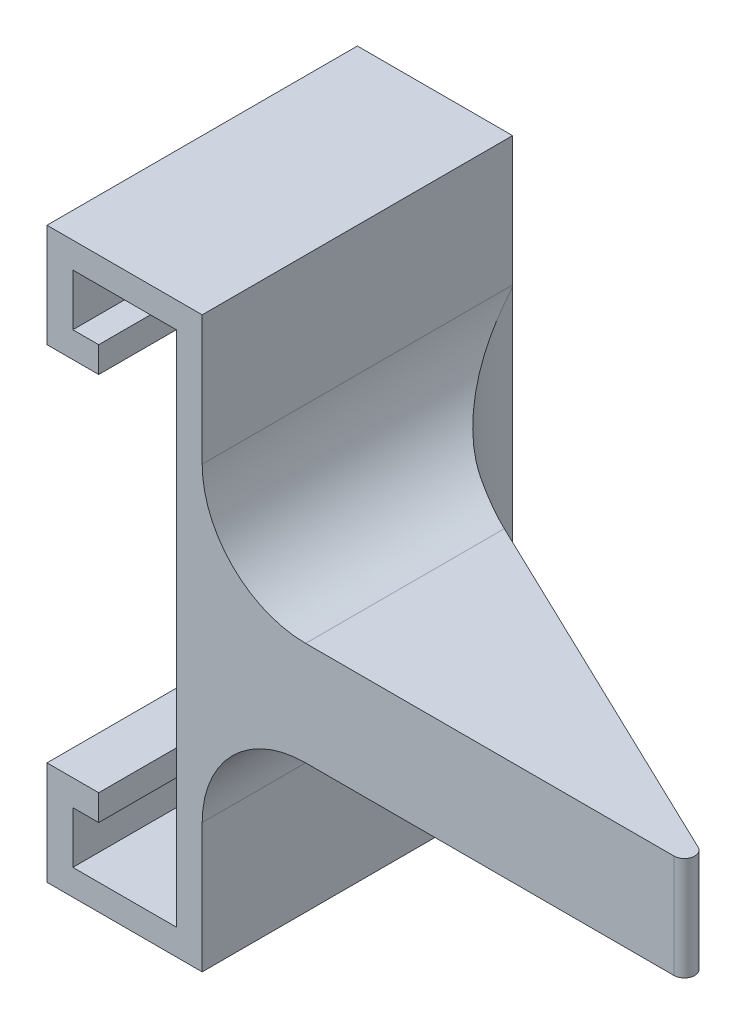
ISO-10303-21;
HEADER;
FILE_DESCRIPTION(('STEP AP214'),'2;1');
FILE_NAME('part.step','',(''),(''),'','','');
FILE_SCHEMA(('AUTOMOTIVE_DESIGN { 1 0 10303 214 1 1 1 1 }'));
ENDSEC;
DATA;
#1=APPLICATION_CONTEXT('core data for automotive mechanical design processes');
#2=APPLICATION_PROTOCOL_DEFINITION('international standard','automotive_design',2000,#1);
#3=PRODUCT_CONTEXT('',#1,'mechanical');
#4=PRODUCT('Part','Part','',(#3));
#5=PRODUCT_RELATED_PRODUCT_CATEGORY('part','',(#4));
#6=PRODUCT_DEFINITION_FORMATION('','',#4);
#7=PRODUCT_DEFINITION_CONTEXT('part definition',#1,'design');
#8=PRODUCT_DEFINITION('design','',#6,#7);
#9=PRODUCT_DEFINITION_SHAPE('','',#8);
#10=(LENGTH_UNIT() NAMED_UNIT(*) SI_UNIT(.MILLI.,.METRE.));
#11=(NAMED_UNIT(*) PLANE_ANGLE_UNIT() SI_UNIT($,.RADIAN.));
#12=(NAMED_UNIT(*) SI_UNIT($,.STERADIAN.) SOLID_ANGLE_UNIT());
#13=UNCERTAINTY_MEASURE_WITH_UNIT(LENGTH_MEASURE(1.E-05),#10,'distance_accuracy_value','');
#14=(GEOMETRIC_REPRESENTATION_CONTEXT(3) GLOBAL_UNCERTAINTY_ASSIGNED_CONTEXT((#13)) GLOBAL_UNIT_ASSIGNED_CONTEXT((#10,
#11,#12)) REPRESENTATION_CONTEXT('',''));
#15=CARTESIAN_POINT('',(0.,0.,0.));
#16=DIRECTION('',(0.,0.,1.));
#17=DIRECTION('',(1.,0.,0.));
#18=AXIS2_PLACEMENT_3D('',#15,#16,#17);
#19=CARTESIAN_POINT('',(10.,10.,30.));
#20=DIRECTION('',(-1.,0.,0.));
#21=DIRECTION('',(0.,-1.,0.));
#22=AXIS2_PLACEMENT_3D('',#19,#20,#21);
#23=PLANE('',#22);
#24=DIRECTION('',(0.,1.,0.));
#25=VECTOR('',#24,1.);
#26=CARTESIAN_POINT('',(10.,10.,30.));
#27=LINE('',#26,#25);
#28=CARTESIAN_POINT('',(10.,-2.50000000000001,30.));
#29=VERTEX_POINT('',#28);
#30=CARTESIAN_POINT('',(10.,10.,30.));
#31=VERTEX_POINT('',#30);
#32=EDGE_CURVE('E376',#29,#31,#27,.T.);
#33=ORIENTED_EDGE('',*,*,#32,.F.);
#34=DIRECTION('',(0.,0.,-1.));
#35=VECTOR('',#34,1.);
#36=CARTESIAN_POINT('',(10.,-2.50000000000001,30.));
#37=LINE('',#36,#35);
#38=CARTESIAN_POINT('',(10.,-2.50000000000001,0.));
#39=VERTEX_POINT('',#38);
#40=EDGE_CURVE('E226',#29,#39,#37,.T.);
#41=ORIENTED_EDGE('',*,*,#40,.T.);
#42=DIRECTION('',(0.,1.,0.));
#43=VECTOR('',#42,1.);
#44=CARTESIAN_POINT('',(10.,10.,0.));
#45=LINE('',#44,#43);
#46=CARTESIAN_POINT('',(10.,10.,0.));
#47=VERTEX_POINT('',#46);
#48=EDGE_CURVE('E398',#39,#47,#45,.T.);
#49=ORIENTED_EDGE('',*,*,#48,.T.);
#50=DIRECTION('',(0.,0.,-1.));
#51=VECTOR('',#50,1.);
#52=CARTESIAN_POINT('',(10.,10.,30.));
#53=LINE('',#52,#51);
#54=EDGE_CURVE('E380',#31,#47,#53,.T.);
#55=ORIENTED_EDGE('',*,*,#54,.F.);
#56=EDGE_LOOP('',(#33,#41,#49,#55));
#57=FACE_BOUND('',#56,.T.);
#58=ADVANCED_FACE('F41',(#57),#23,.F.);
#59=CARTESIAN_POINT('',(10.,-45.,0.));
#60=VERTEX_POINT('',#59);
#61=CARTESIAN_POINT('',(10.,-32.5,0.));
#62=VERTEX_POINT('',#61);
#63=EDGE_CURVE('E397',#60,#62,#45,.T.);
#64=ORIENTED_EDGE('',*,*,#63,.T.);
#65=DIRECTION('',(0.,0.,-1.));
#66=VECTOR('',#65,1.);
#67=CARTESIAN_POINT('',(10.,-32.5,30.));
#68=LINE('',#67,#66);
#69=CARTESIAN_POINT('',(10.,-32.5,30.));
#70=VERTEX_POINT('',#69);
#71=EDGE_CURVE('E224',#62,#70,#68,.F.);
#72=ORIENTED_EDGE('',*,*,#71,.T.);
#73=CARTESIAN_POINT('',(10.,-45.,30.));
#74=VERTEX_POINT('',#73);
#75=EDGE_CURVE('E382',#74,#70,#27,.T.);
#76=ORIENTED_EDGE('',*,*,#75,.F.);
#77=DIRECTION('',(0.,0.,-1.));
#78=VECTOR('',#77,1.);
#79=CARTESIAN_POINT('',(10.,-45.,30.));
#80=LINE('',#79,#78);
#81=EDGE_CURVE('E418',#74,#60,#80,.T.);
#82=ORIENTED_EDGE('',*,*,#81,.T.);
#83=EDGE_LOOP('',(#64,#72,#76,#82));
#84=FACE_BOUND('',#83,.T.);
#85=ADVANCED_FACE('F290',(#84),#23,.F.);
#86=CARTESIAN_POINT('',(0.,2.5,30.));
#87=DIRECTION('',(-1.,0.,0.));
#88=DIRECTION('',(0.,-1.,0.));
#89=AXIS2_PLACEMENT_3D('',#86,#87,#88);
#90=PLANE('',#89);
#91=DIRECTION('',(0.,1.,0.));
#92=VECTOR('',#91,1.);
#93=CARTESIAN_POINT('',(0.,2.5,0.));
#94=LINE('',#93,#92);
#95=CARTESIAN_POINT('',(0.,0.,0.));
#96=VERTEX_POINT('',#95);
#97=CARTESIAN_POINT('',(0.,2.5,0.));
#98=VERTEX_POINT('',#97);
#99=EDGE_CURVE('E223',#96,#98,#94,.T.);
#100=ORIENTED_EDGE('',*,*,#99,.T.);
#101=DIRECTION('',(0.,0.,-1.));
#102=VECTOR('',#101,1.);
#103=CARTESIAN_POINT('',(0.,2.5,30.));
#104=LINE('',#103,#102);
#105=CARTESIAN_POINT('',(0.,2.5,30.));
#106=VERTEX_POINT('',#105);
#107=EDGE_CURVE('E204',#106,#98,#104,.T.);
#108=ORIENTED_EDGE('',*,*,#107,.F.);
#109=DIRECTION('',(0.,1.,0.));
#110=VECTOR('',#109,1.);
#111=CARTESIAN_POINT('',(0.,2.5,30.));
#112=LINE('',#111,#110);
#113=CARTESIAN_POINT('',(0.,0.,30.));
#114=VERTEX_POINT('',#113);
#115=EDGE_CURVE('E210',#114,#106,#112,.T.);
#116=ORIENTED_EDGE('',*,*,#115,.F.);
#117=DIRECTION('',(0.,0.,-1.));
#118=VECTOR('',#117,1.);
#119=CARTESIAN_POINT('',(0.,0.,30.));
#120=LINE('',#119,#118);
#121=EDGE_CURVE('E409',#114,#96,#120,.T.);
#122=ORIENTED_EDGE('',*,*,#121,.T.);
#123=EDGE_LOOP('',(#100,#108,#116,#122));
#124=FACE_BOUND('',#123,.T.);
#125=ADVANCED_FACE('F221',(#124),#90,.F.);
#126=CARTESIAN_POINT('',(-2.5,2.5,30.));
#127=DIRECTION('',(0.,-1.,0.));
#128=DIRECTION('',(0.,0.,-1.));
#129=AXIS2_PLACEMENT_3D('',#126,#127,#128);
#130=PLANE('',#129);
#131=DIRECTION('',(-1.,0.,0.));
#132=VECTOR('',#131,1.);
#133=CARTESIAN_POINT('',(-2.5,2.5,0.));
#134=LINE('',#133,#132);
#135=CARTESIAN_POINT('',(-2.5,2.5,0.));
#136=VERTEX_POINT('',#135);
#137=EDGE_CURVE('E459',#98,#136,#134,.T.);
#138=ORIENTED_EDGE('',*,*,#137,.T.);
#139=DIRECTION('',(0.,0.,-1.));
#140=VECTOR('',#139,1.);
#141=CARTESIAN_POINT('',(-2.5,2.5,30.));
#142=LINE('',#141,#140);
#143=CARTESIAN_POINT('',(-2.5,2.5,30.));
#144=VERTEX_POINT('',#143);
#145=EDGE_CURVE('E207',#144,#136,#142,.T.);
#146=ORIENTED_EDGE('',*,*,#145,.F.);
#147=DIRECTION('',(-1.,0.,0.));
#148=VECTOR('',#147,1.);
#149=CARTESIAN_POINT('',(-2.5,2.5,30.));
#150=LINE('',#149,#148);
#151=EDGE_CURVE('E200',#106,#144,#150,.T.);
#152=ORIENTED_EDGE('',*,*,#151,.F.);
#153=ORIENTED_EDGE('',*,*,#107,.T.);
#154=EDGE_LOOP('',(#138,#146,#152,#153));
#155=FACE_BOUND('',#154,.T.);
#156=ADVANCED_FACE('F202',(#155),#130,.F.);
#157=CARTESIAN_POINT('',(-2.5,7.5,30.));
#158=DIRECTION('',(-1.,0.,0.));
#159=DIRECTION('',(0.,-1.,0.));
#160=AXIS2_PLACEMENT_3D('',#157,#158,#159);
#161=PLANE('',#160);
#162=DIRECTION('',(0.,1.,0.));
#163=VECTOR('',#162,1.);
#164=CARTESIAN_POINT('',(-2.5,7.5,0.));
#165=LINE('',#164,#163);
#166=CARTESIAN_POINT('',(-2.5,7.5,0.));
#167=VERTEX_POINT('',#166);
#168=EDGE_CURVE('E453',#136,#167,#165,.T.);
#169=ORIENTED_EDGE('',*,*,#168,.T.);
#170=DIRECTION('',(0.,0.,-1.));
#171=VECTOR('',#170,1.);
#172=CARTESIAN_POINT('',(-2.5,7.5,30.));
#173=LINE('',#172,#171);
#174=CARTESIAN_POINT('',(-2.5,7.5,30.));
#175=VERTEX_POINT('',#174);
#176=EDGE_CURVE('E228',#175,#167,#173,.T.);
#177=ORIENTED_EDGE('',*,*,#176,.F.);
#178=DIRECTION('',(0.,1.,0.));
#179=VECTOR('',#178,1.);
#180=CARTESIAN_POINT('',(-2.5,7.5,30.));
#181=LINE('',#180,#179);
#182=EDGE_CURVE('E209',#144,#175,#181,.T.);
#183=ORIENTED_EDGE('',*,*,#182,.F.);
#184=ORIENTED_EDGE('',*,*,#145,.T.);
#185=EDGE_LOOP('',(#169,#177,#183,#184));
#186=FACE_BOUND('',#185,.T.);
#187=ADVANCED_FACE('F328',(#186),#161,.F.);
#188=CARTESIAN_POINT('',(7.5,7.5,30.));
#189=DIRECTION('',(0.,1.,0.));
#190=DIRECTION('',(-1.,0.,0.));
#191=AXIS2_PLACEMENT_3D('',#188,#189,#190);
#192=PLANE('',#191);
#193=DIRECTION('',(1.,0.,0.));
#194=VECTOR('',#193,1.);
#195=CARTESIAN_POINT('',(7.5,7.5,0.));
#196=LINE('',#195,#194);
#197=CARTESIAN_POINT('',(7.5,7.5,0.));
#198=VERTEX_POINT('',#197);
#199=EDGE_CURVE('E449',#167,#198,#196,.T.);
#200=ORIENTED_EDGE('',*,*,#199,.T.);
#201=DIRECTION('',(0.,0.,-1.));
#202=VECTOR('',#201,1.);
#203=CARTESIAN_POINT('',(7.5,7.5,30.));
#204=LINE('',#203,#202);
#205=CARTESIAN_POINT('',(7.5,7.5,30.));
#206=VERTEX_POINT('',#205);
#207=EDGE_CURVE('E442',#206,#198,#204,.T.);
#208=ORIENTED_EDGE('',*,*,#207,.F.);
#209=DIRECTION('',(1.,0.,0.));
#210=VECTOR('',#209,1.);
#211=CARTESIAN_POINT('',(7.5,7.5,30.));
#212=LINE('',#211,#210);
#213=EDGE_CURVE('E450',#175,#206,#212,.T.);
#214=ORIENTED_EDGE('',*,*,#213,.F.);
#215=ORIENTED_EDGE('',*,*,#176,.T.);
#216=EDGE_LOOP('',(#200,#208,#214,#215));
#217=FACE_BOUND('',#216,.T.);
#218=ADVANCED_FACE('F324',(#217),#192,.F.);
#219=CARTESIAN_POINT('',(7.5,-42.5,30.));
#220=DIRECTION('',(1.,0.,0.));
#221=DIRECTION('',(0.,1.,0.));
#222=AXIS2_PLACEMENT_3D('',#219,#220,#221);
#223=PLANE('',#222);
#224=DIRECTION('',(0.,-1.,0.));
#225=VECTOR('',#224,1.);
#226=CARTESIAN_POINT('',(7.5,-42.5,0.));
#227=LINE('',#226,#225);
#228=CARTESIAN_POINT('',(7.5,-42.5,0.));
#229=VERTEX_POINT('',#228);
#230=EDGE_CURVE('E455',#198,#229,#227,.T.);
#231=ORIENTED_EDGE('',*,*,#230,.T.);
#232=DIRECTION('',(0.,0.,-1.));
#233=VECTOR('',#232,1.);
#234=CARTESIAN_POINT('',(7.5,-42.5,30.));
#235=LINE('',#234,#233);
#236=CARTESIAN_POINT('',(7.5,-42.5,30.));
#237=VERTEX_POINT('',#236);
#238=EDGE_CURVE('E439',#237,#229,#235,.T.);
#239=ORIENTED_EDGE('',*,*,#238,.F.);
#240=DIRECTION('',(0.,-1.,0.));
#241=VECTOR('',#240,1.);
#242=CARTESIAN_POINT('',(7.5,-42.5,30.));
#243=LINE('',#242,#241);
#244=EDGE_CURVE('E490',#206,#237,#243,.T.);
#245=ORIENTED_EDGE('',*,*,#244,.F.);
#246=ORIENTED_EDGE('',*,*,#207,.T.);
#247=EDGE_LOOP('',(#231,#239,#245,#246));
#248=FACE_BOUND('',#247,.T.);
#249=ADVANCED_FACE('F320',(#248),#223,.F.);
#250=CARTESIAN_POINT('',(-2.5,-42.5,30.));
#251=DIRECTION('',(0.,-1.,0.));
#252=DIRECTION('',(0.,0.,-1.));
#253=AXIS2_PLACEMENT_3D('',#250,#251,#252);
#254=PLANE('',#253);
#255=DIRECTION('',(-1.,0.,0.));
#256=VECTOR('',#255,1.);
#257=CARTESIAN_POINT('',(-2.5,-42.5,0.));
#258=LINE('',#257,#256);
#259=CARTESIAN_POINT('',(-2.5,-42.5,0.));
#260=VERTEX_POINT('',#259);
#261=EDGE_CURVE('E457',#229,#260,#258,.T.);
#262=ORIENTED_EDGE('',*,*,#261,.T.);
#263=DIRECTION('',(0.,0.,-1.));
#264=VECTOR('',#263,1.);
#265=CARTESIAN_POINT('',(-2.5,-42.5,30.));
#266=LINE('',#265,#264);
#267=CARTESIAN_POINT('',(-2.5,-42.5,30.));
#268=VERTEX_POINT('',#267);
#269=EDGE_CURVE('E436',#268,#260,#266,.T.);
#270=ORIENTED_EDGE('',*,*,#269,.F.);
#271=DIRECTION('',(-1.,0.,0.));
#272=VECTOR('',#271,1.);
#273=CARTESIAN_POINT('',(-2.5,-42.5,30.));
#274=LINE('',#273,#272);
#275=EDGE_CURVE('E494',#237,#268,#274,.T.);
#276=ORIENTED_EDGE('',*,*,#275,.F.);
#277=ORIENTED_EDGE('',*,*,#238,.T.);
#278=EDGE_LOOP('',(#262,#270,#276,#277));
#279=FACE_BOUND('',#278,.T.);
#280=ADVANCED_FACE('F316',(#279),#254,.F.);
#281=CARTESIAN_POINT('',(-2.5,-37.5,30.));
#282=DIRECTION('',(-1.,0.,0.));
#283=DIRECTION('',(0.,-1.,0.));
#284=AXIS2_PLACEMENT_3D('',#281,#282,#283);
#285=PLANE('',#284);
#286=DIRECTION('',(0.,1.,0.));
#287=VECTOR('',#286,1.);
#288=CARTESIAN_POINT('',(-2.5,-37.5,0.));
#289=LINE('',#288,#287);
#290=CARTESIAN_POINT('',(-2.5,-37.5,0.));
#291=VERTEX_POINT('',#290);
#292=EDGE_CURVE('E464',#260,#291,#289,.T.);
#293=ORIENTED_EDGE('',*,*,#292,.T.);
#294=DIRECTION('',(0.,0.,-1.));
#295=VECTOR('',#294,1.);
#296=CARTESIAN_POINT('',(-2.5,-37.5,30.));
#297=LINE('',#296,#295);
#298=CARTESIAN_POINT('',(-2.5,-37.5,30.));
#299=VERTEX_POINT('',#298);
#300=EDGE_CURVE('E433',#299,#291,#297,.T.);
#301=ORIENTED_EDGE('',*,*,#300,.F.);
#302=DIRECTION('',(0.,1.,0.));
#303=VECTOR('',#302,1.);
#304=CARTESIAN_POINT('',(-2.5,-37.5,30.));
#305=LINE('',#304,#303);
#306=EDGE_CURVE('E496',#268,#299,#305,.T.);
#307=ORIENTED_EDGE('',*,*,#306,.F.);
#308=ORIENTED_EDGE('',*,*,#269,.T.);
#309=EDGE_LOOP('',(#293,#301,#307,#308));
#310=FACE_BOUND('',#309,.T.);
#311=ADVANCED_FACE('F312',(#310),#285,.F.);
#312=CARTESIAN_POINT('',(0.,-37.5,30.));
#313=DIRECTION('',(0.,1.,0.));
#314=DIRECTION('',(0.,0.,1.));
#315=AXIS2_PLACEMENT_3D('',#312,#313,#314);
#316=PLANE('',#315);
#317=DIRECTION('',(1.,0.,0.));
#318=VECTOR('',#317,1.);
#319=CARTESIAN_POINT('',(0.,-37.5,0.));
#320=LINE('',#319,#318);
#321=CARTESIAN_POINT('',(0.,-37.5,0.));
#322=VERTEX_POINT('',#321);
#323=EDGE_CURVE('E466',#291,#322,#320,.T.);
#324=ORIENTED_EDGE('',*,*,#323,.T.);
#325=DIRECTION('',(0.,0.,-1.));
#326=VECTOR('',#325,1.);
#327=CARTESIAN_POINT('',(0.,-37.5,30.));
#328=LINE('',#327,#326);
#329=CARTESIAN_POINT('',(0.,-37.5,30.));
#330=VERTEX_POINT('',#329);
#331=EDGE_CURVE('E430',#330,#322,#328,.T.);
#332=ORIENTED_EDGE('',*,*,#331,.F.);
#333=DIRECTION('',(1.,0.,0.));
#334=VECTOR('',#333,1.);
#335=CARTESIAN_POINT('',(0.,-37.5,30.));
#336=LINE('',#335,#334);
#337=EDGE_CURVE('E498',#299,#330,#336,.T.);
#338=ORIENTED_EDGE('',*,*,#337,.F.);
#339=ORIENTED_EDGE('',*,*,#300,.T.);
#340=EDGE_LOOP('',(#324,#332,#338,#339));
#341=FACE_BOUND('',#340,.T.);
#342=ADVANCED_FACE('F308',(#341),#316,.F.);
#343=CARTESIAN_POINT('',(0.,-35.,30.));
#344=DIRECTION('',(-1.,0.,0.));
#345=DIRECTION('',(0.,-1.,0.));
#346=AXIS2_PLACEMENT_3D('',#343,#344,#345);
#347=PLANE('',#346);
#348=DIRECTION('',(0.,1.,0.));
#349=VECTOR('',#348,1.);
#350=CARTESIAN_POINT('',(0.,-35.,0.));
#351=LINE('',#350,#349);
#352=CARTESIAN_POINT('',(0.,-35.,0.));
#353=VERTEX_POINT('',#352);
#354=EDGE_CURVE('E468',#322,#353,#351,.T.);
#355=ORIENTED_EDGE('',*,*,#354,.T.);
#356=DIRECTION('',(0.,0.,-1.));
#357=VECTOR('',#356,1.);
#358=CARTESIAN_POINT('',(0.,-35.,30.));
#359=LINE('',#358,#357);
#360=CARTESIAN_POINT('',(0.,-35.,30.));
#361=VERTEX_POINT('',#360);
#362=EDGE_CURVE('E427',#361,#353,#359,.T.);
#363=ORIENTED_EDGE('',*,*,#362,.F.);
#364=DIRECTION('',(0.,1.,0.));
#365=VECTOR('',#364,1.);
#366=CARTESIAN_POINT('',(0.,-35.,30.));
#367=LINE('',#366,#365);
#368=EDGE_CURVE('E500',#330,#361,#367,.T.);
#369=ORIENTED_EDGE('',*,*,#368,.F.);
#370=ORIENTED_EDGE('',*,*,#331,.T.);
#371=EDGE_LOOP('',(#355,#363,#369,#370));
#372=FACE_BOUND('',#371,.T.);
#373=ADVANCED_FACE('F304',(#372),#347,.F.);
#374=CARTESIAN_POINT('',(-5.,-35.,30.));
#375=DIRECTION('',(0.,-1.,0.));
#376=DIRECTION('',(1.,0.,0.));
#377=AXIS2_PLACEMENT_3D('',#374,#375,#376);
#378=PLANE('',#377);
#379=DIRECTION('',(-1.,0.,0.));
#380=VECTOR('',#379,1.);
#381=CARTESIAN_POINT('',(-5.,-35.,0.));
#382=LINE('',#381,#380);
#383=CARTESIAN_POINT('',(-5.,-35.,0.));
#384=VERTEX_POINT('',#383);
#385=EDGE_CURVE('E470',#353,#384,#382,.T.);
#386=ORIENTED_EDGE('',*,*,#385,.T.);
#387=DIRECTION('',(0.,0.,-1.));
#388=VECTOR('',#387,1.);
#389=CARTESIAN_POINT('',(-5.,-35.,30.));
#390=LINE('',#389,#388);
#391=CARTESIAN_POINT('',(-5.,-35.,30.));
#392=VERTEX_POINT('',#391);
#393=EDGE_CURVE('E424',#392,#384,#390,.T.);
#394=ORIENTED_EDGE('',*,*,#393,.F.);
#395=DIRECTION('',(-1.,0.,0.));
#396=VECTOR('',#395,1.);
#397=CARTESIAN_POINT('',(-5.,-35.,30.));
#398=LINE('',#397,#396);
#399=EDGE_CURVE('E502',#361,#392,#398,.T.);
#400=ORIENTED_EDGE('',*,*,#399,.F.);
#401=ORIENTED_EDGE('',*,*,#362,.T.);
#402=EDGE_LOOP('',(#386,#394,#400,#401));
#403=FACE_BOUND('',#402,.T.);
#404=ADVANCED_FACE('F300',(#403),#378,.F.);
#405=CARTESIAN_POINT('',(-5.,-45.,30.));
#406=DIRECTION('',(1.,0.,0.));
#407=DIRECTION('',(0.,1.,0.));
#408=AXIS2_PLACEMENT_3D('',#405,#406,#407);
#409=PLANE('',#408);
#410=DIRECTION('',(0.,-1.,0.));
#411=VECTOR('',#410,1.);
#412=CARTESIAN_POINT('',(-5.,-45.,0.));
#413=LINE('',#412,#411);
#414=CARTESIAN_POINT('',(-5.,-45.,0.));
#415=VERTEX_POINT('',#414);
#416=EDGE_CURVE('E471',#384,#415,#413,.T.);
#417=ORIENTED_EDGE('',*,*,#416,.T.);
#418=DIRECTION('',(0.,0.,-1.));
#419=VECTOR('',#418,1.);
#420=CARTESIAN_POINT('',(-5.,-45.,30.));
#421=LINE('',#420,#419);
#422=CARTESIAN_POINT('',(-5.,-45.,30.));
#423=VERTEX_POINT('',#422);
#424=EDGE_CURVE('E421',#423,#415,#421,.T.);
#425=ORIENTED_EDGE('',*,*,#424,.F.);
#426=DIRECTION('',(0.,-1.,0.));
#427=VECTOR('',#426,1.);
#428=CARTESIAN_POINT('',(-5.,-45.,30.));
#429=LINE('',#428,#427);
#430=EDGE_CURVE('E503',#392,#423,#429,.T.);
#431=ORIENTED_EDGE('',*,*,#430,.F.);
#432=ORIENTED_EDGE('',*,*,#393,.T.);
#433=EDGE_LOOP('',(#417,#425,#431,#432));
#434=FACE_BOUND('',#433,.T.);
#435=ADVANCED_FACE('F296',(#434),#409,.F.);
#436=CARTESIAN_POINT('',(10.,-45.,30.));
#437=DIRECTION('',(0.,1.,0.));
#438=DIRECTION('',(0.,0.,1.));
#439=AXIS2_PLACEMENT_3D('',#436,#437,#438);
#440=PLANE('',#439);
#441=DIRECTION('',(1.,0.,0.));
#442=VECTOR('',#441,1.);
#443=CARTESIAN_POINT('',(10.,-45.,0.));
#444=LINE('',#443,#442);
#445=EDGE_CURVE('E401',#415,#60,#444,.T.);
#446=ORIENTED_EDGE('',*,*,#445,.T.);
#447=ORIENTED_EDGE('',*,*,#81,.F.);
#448=DIRECTION('',(1.,0.,0.));
#449=VECTOR('',#448,1.);
#450=CARTESIAN_POINT('',(10.,-45.,30.));
#451=LINE('',#450,#449);
#452=EDGE_CURVE('E383',#423,#74,#451,.T.);
#453=ORIENTED_EDGE('',*,*,#452,.F.);
#454=ORIENTED_EDGE('',*,*,#424,.T.);
#455=EDGE_LOOP('',(#446,#447,#453,#454));
#456=FACE_BOUND('',#455,.T.);
#457=ADVANCED_FACE('F288',(#456),#440,.F.);
#458=CARTESIAN_POINT('',(-5.,10.,30.));
#459=DIRECTION('',(0.,-1.,0.));
#460=DIRECTION('',(1.,0.,0.));
#461=AXIS2_PLACEMENT_3D('',#458,#459,#460);
#462=PLANE('',#461);
#463=DIRECTION('',(-1.,0.,0.));
#464=VECTOR('',#463,1.);
#465=CARTESIAN_POINT('',(-5.,10.,0.));
#466=LINE('',#465,#464);
#467=CARTESIAN_POINT('',(-5.,10.,0.));
#468=VERTEX_POINT('',#467);
#469=EDGE_CURVE('E400',#47,#468,#466,.T.);
#470=ORIENTED_EDGE('',*,*,#469,.T.);
#471=DIRECTION('',(0.,0.,-1.));
#472=VECTOR('',#471,1.);
#473=CARTESIAN_POINT('',(-5.,10.,30.));
#474=LINE('',#473,#472);
#475=CARTESIAN_POINT('',(-5.,10.,30.));
#476=VERTEX_POINT('',#475);
#477=EDGE_CURVE('E414',#476,#468,#474,.T.);
#478=ORIENTED_EDGE('',*,*,#477,.F.);
#479=DIRECTION('',(-1.,0.,0.));
#480=VECTOR('',#479,1.);
#481=CARTESIAN_POINT('',(-5.,10.,30.));
#482=LINE('',#481,#480);
#483=EDGE_CURVE('E480',#31,#476,#482,.T.);
#484=ORIENTED_EDGE('',*,*,#483,.F.);
#485=ORIENTED_EDGE('',*,*,#54,.T.);
#486=EDGE_LOOP('',(#470,#478,#484,#485));
#487=FACE_BOUND('',#486,.T.);
#488=ADVANCED_FACE('F284',(#487),#462,.F.);
#489=CARTESIAN_POINT('',(-5.,0.,30.));
#490=DIRECTION('',(1.,0.,0.));
#491=DIRECTION('',(0.,0.,-1.));
#492=AXIS2_PLACEMENT_3D('',#489,#490,#491);
#493=PLANE('',#492);
#494=DIRECTION('',(0.,-1.,0.));
#495=VECTOR('',#494,1.);
#496=CARTESIAN_POINT('',(-5.,0.,0.));
#497=LINE('',#496,#495);
#498=CARTESIAN_POINT('',(-5.,0.,0.));
#499=VERTEX_POINT('',#498);
#500=EDGE_CURVE('E406',#468,#499,#497,.T.);
#501=ORIENTED_EDGE('',*,*,#500,.T.);
#502=DIRECTION('',(0.,0.,-1.));
#503=VECTOR('',#502,1.);
#504=CARTESIAN_POINT('',(-5.,0.,30.));
#505=LINE('',#504,#503);
#506=CARTESIAN_POINT('',(-5.,0.,30.));
#507=VERTEX_POINT('',#506);
#508=EDGE_CURVE('E411',#507,#499,#505,.T.);
#509=ORIENTED_EDGE('',*,*,#508,.F.);
#510=DIRECTION('',(0.,-1.,0.));
#511=VECTOR('',#510,1.);
#512=CARTESIAN_POINT('',(-5.,0.,30.));
#513=LINE('',#512,#511);
#514=EDGE_CURVE('E481',#476,#507,#513,.T.);
#515=ORIENTED_EDGE('',*,*,#514,.F.);
#516=ORIENTED_EDGE('',*,*,#477,.T.);
#517=EDGE_LOOP('',(#501,#509,#515,#516));
#518=FACE_BOUND('',#517,.T.);
#519=ADVANCED_FACE('F280',(#518),#493,.F.);
#520=CARTESIAN_POINT('',(0.,0.,30.));
#521=DIRECTION('',(0.,1.,0.));
#522=DIRECTION('',(-1.,0.,0.));
#523=AXIS2_PLACEMENT_3D('',#520,#521,#522);
#524=PLANE('',#523);
#525=DIRECTION('',(1.,0.,0.));
#526=VECTOR('',#525,1.);
#527=CARTESIAN_POINT('',(0.,0.,0.));
#528=LINE('',#527,#526);
#529=EDGE_CURVE('E219',#499,#96,#528,.T.);
#530=ORIENTED_EDGE('',*,*,#529,.T.);
#531=ORIENTED_EDGE('',*,*,#121,.F.);
#532=DIRECTION('',(1.,0.,0.));
#533=VECTOR('',#532,1.);
#534=CARTESIAN_POINT('',(0.,0.,30.));
#535=LINE('',#534,#533);
#536=EDGE_CURVE('E215',#507,#114,#535,.T.);
#537=ORIENTED_EDGE('',*,*,#536,.F.);
#538=ORIENTED_EDGE('',*,*,#508,.T.);
#539=EDGE_LOOP('',(#530,#531,#537,#538));
#540=FACE_BOUND('',#539,.T.);
#541=ADVANCED_FACE('F274',(#540),#524,.F.);
#542=CARTESIAN_POINT('',(0.,0.,30.));
#543=DIRECTION('',(0.,0.,-1.));
#544=DIRECTION('',(-1.,0.,0.));
#545=AXIS2_PLACEMENT_3D('',#542,#543,#544);
#546=PLANE('',#545);
#547=DIRECTION('',(-1.,0.,0.));
#548=VECTOR('',#547,1.);
#549=CARTESIAN_POINT('',(60.,-22.5,30.));
#550=LINE('',#549,#548);
#551=CARTESIAN_POINT('',(55.6057625626897,-22.5,30.));
#552=VERTEX_POINT('',#551);
#553=CARTESIAN_POINT('',(20.,-22.5,30.));
#554=VERTEX_POINT('',#553);
#555=EDGE_CURVE('E526',#552,#554,#550,.T.);
#556=ORIENTED_EDGE('',*,*,#555,.F.);
#557=DIRECTION('',(0.,-1.,0.));
#558=VECTOR('',#557,1.);
#559=CARTESIAN_POINT('',(55.6057625626897,-12.5,30.));
#560=LINE('',#559,#558);
#561=CARTESIAN_POINT('',(55.6057625626897,-12.5,30.));
#562=VERTEX_POINT('',#561);
#563=EDGE_CURVE('E49',#552,#562,#560,.F.);
#564=ORIENTED_EDGE('',*,*,#563,.T.);
#565=DIRECTION('',(-1.,0.,0.));
#566=VECTOR('',#565,1.);
#567=CARTESIAN_POINT('',(60.,-12.5,30.));
#568=LINE('',#567,#566);
#569=CARTESIAN_POINT('',(20.,-12.5,30.));
#570=VERTEX_POINT('',#569);
#571=EDGE_CURVE('E488',#562,#570,#568,.T.);
#572=ORIENTED_EDGE('',*,*,#571,.T.);
#573=CARTESIAN_POINT('',(20.,-2.50000000000001,30.));
#574=DIRECTION('',(0.,0.,-1.));
#575=DIRECTION('',(-1.,0.,0.));
#576=AXIS2_PLACEMENT_3D('',#573,#574,#575);
#577=CIRCLE('',#576,10.);
#578=EDGE_CURVE('E243',#570,#29,#577,.T.);
#579=ORIENTED_EDGE('',*,*,#578,.T.);
#580=ORIENTED_EDGE('',*,*,#32,.T.);
#581=ORIENTED_EDGE('',*,*,#483,.T.);
#582=ORIENTED_EDGE('',*,*,#514,.T.);
#583=ORIENTED_EDGE('',*,*,#536,.T.);
#584=ORIENTED_EDGE('',*,*,#115,.T.);
#585=ORIENTED_EDGE('',*,*,#151,.T.);
#586=ORIENTED_EDGE('',*,*,#182,.T.);
#587=ORIENTED_EDGE('',*,*,#213,.T.);
#588=ORIENTED_EDGE('',*,*,#244,.T.);
#589=ORIENTED_EDGE('',*,*,#275,.T.);
#590=ORIENTED_EDGE('',*,*,#306,.T.);
#591=ORIENTED_EDGE('',*,*,#337,.T.);
#592=ORIENTED_EDGE('',*,*,#368,.T.);
#593=ORIENTED_EDGE('',*,*,#399,.T.);
#594=ORIENTED_EDGE('',*,*,#430,.T.);
#595=ORIENTED_EDGE('',*,*,#452,.T.);
#596=ORIENTED_EDGE('',*,*,#75,.T.);
#597=CARTESIAN_POINT('',(20.,-32.5,30.));
#598=DIRECTION('',(0.,0.,-1.));
#599=DIRECTION('',(-1.,0.,0.));
#600=AXIS2_PLACEMENT_3D('',#597,#598,#599);
#601=CIRCLE('',#600,10.);
#602=EDGE_CURVE('E247',#70,#554,#601,.T.);
#603=ORIENTED_EDGE('',*,*,#602,.T.);
#604=EDGE_LOOP('',(#556,#564,#572,#579,#580,#581,#582,#583,#584,#585,#586,#587,#588,#589,#590,
#591,#592,#593,#594,#595,#596,#603));
#605=FACE_BOUND('',#604,.T.);
#606=ADVANCED_FACE('F213',(#605),#546,.F.);
#607=CARTESIAN_POINT('',(0.,0.,0.));
#608=DIRECTION('',(0.,0.,-1.));
#609=DIRECTION('',(-1.,0.,0.));
#610=AXIS2_PLACEMENT_3D('',#607,#608,#609);
#611=PLANE('',#610);
#612=ORIENTED_EDGE('',*,*,#99,.F.);
#613=ORIENTED_EDGE('',*,*,#529,.F.);
#614=ORIENTED_EDGE('',*,*,#500,.F.);
#615=ORIENTED_EDGE('',*,*,#469,.F.);
#616=ORIENTED_EDGE('',*,*,#48,.F.);
#617=EDGE_CURVE('E392',#62,#39,#45,.T.);
#618=ORIENTED_EDGE('',*,*,#617,.F.);
#619=ORIENTED_EDGE('',*,*,#63,.F.);
#620=ORIENTED_EDGE('',*,*,#445,.F.);
#621=ORIENTED_EDGE('',*,*,#416,.F.);
#622=ORIENTED_EDGE('',*,*,#385,.F.);
#623=ORIENTED_EDGE('',*,*,#354,.F.);
#624=ORIENTED_EDGE('',*,*,#323,.F.);
#625=ORIENTED_EDGE('',*,*,#292,.F.);
#626=ORIENTED_EDGE('',*,*,#261,.F.);
#627=ORIENTED_EDGE('',*,*,#230,.F.);
#628=ORIENTED_EDGE('',*,*,#199,.F.);
#629=ORIENTED_EDGE('',*,*,#168,.F.);
#630=ORIENTED_EDGE('',*,*,#137,.F.);
#631=EDGE_LOOP('',(#612,#613,#614,#615,#616,#618,#619,#620,#621,#622,#623,#624,#625,#626,#627,
#628,#629,#630));
#632=FACE_BOUND('',#631,.T.);
#633=ADVANCED_FACE('F268',(#632),#611,.T.);
#634=CARTESIAN_POINT('',(10.,-12.5,6.));
#635=DIRECTION('',(0.432731067584771,0.,-0.901523057468274));
#636=DIRECTION('',(-0.901523057468274,0.,-0.432731067584771));
#637=AXIS2_PLACEMENT_3D('',#634,#635,#636);
#638=PLANE('',#637);
#639=DIRECTION('',(0.901523057468274,0.,0.432731067584771));
#640=VECTOR('',#639,1.);
#641=CARTESIAN_POINT('',(10.,-12.5,6.));
#642=LINE('',#641,#640);
#643=CARTESIAN_POINT('',(20.,-12.5,10.8));
#644=VERTEX_POINT('',#643);
#645=CARTESIAN_POINT('',(56.0384936302745,-12.5,28.0984769425317));
#646=VERTEX_POINT('',#645);
#647=EDGE_CURVE('E523',#644,#646,#642,.T.);
#648=ORIENTED_EDGE('',*,*,#647,.T.);
#649=DIRECTION('',(0.,-1.,0.));
#650=VECTOR('',#649,1.);
#651=CARTESIAN_POINT('',(56.0384936302744,-22.5,28.0984769425317));
#652=LINE('',#651,#650);
#653=CARTESIAN_POINT('',(56.0384936302745,-22.5,28.0984769425317));
#654=VERTEX_POINT('',#653);
#655=EDGE_CURVE('E360',#646,#654,#652,.T.);
#656=ORIENTED_EDGE('',*,*,#655,.T.);
#657=DIRECTION('',(0.901523057468274,0.,0.432731067584771));
#658=VECTOR('',#657,1.);
#659=CARTESIAN_POINT('',(10.,-22.5,6.));
#660=LINE('',#659,#658);
#661=CARTESIAN_POINT('',(20.,-22.5,10.8));
#662=VERTEX_POINT('',#661);
#663=EDGE_CURVE('E359',#662,#654,#660,.T.);
#664=ORIENTED_EDGE('',*,*,#663,.F.);
#665=CARTESIAN_POINT('',(20.,-32.5,10.8));
#666=DIRECTION('',(0.432731067584771,0.,-0.901523057468274));
#667=DIRECTION('',(0.901523057468274,0.,0.432731067584771));
#668=AXIS2_PLACEMENT_3D('',#665,#666,#667);
#669=ELLIPSE('',#668,11.0923396990896,10.);
#670=CARTESIAN_POINT('',(15.6683542113843,-23.4868515621916,8.72081002146445));
#671=VERTEX_POINT('',#670);
#672=EDGE_CURVE('E245',#662,#671,#669,.F.);
#673=ORIENTED_EDGE('',*,*,#672,.T.);
#674=CARTESIAN_POINT('',(15.6683542113843,-23.4868515621916,8.72081002146445));
#675=CARTESIAN_POINT('',(15.6683542113843,-22.5,8.72081002146445));
#676=B_SPLINE_CURVE_WITH_KNOTS('',1,(#674,#675),.UNSPECIFIED.,.F.,.F.,(2,2),(0.,1.),.UNSPECIFIED.);
#677=CARTESIAN_POINT('',(15.6683542113843,-22.5,8.72081002146445));
#678=VERTEX_POINT('',#677);
#679=EDGE_CURVE('E250',#671,#678,#676,.T.);
#680=ORIENTED_EDGE('',*,*,#679,.T.);
#681=DIRECTION('',(0.,1.,0.));
#682=VECTOR('',#681,1.);
#683=CARTESIAN_POINT('',(15.6683542113843,-12.5,8.72081002146444));
#684=LINE('',#683,#682);
#685=CARTESIAN_POINT('',(15.6683542113843,-12.5,8.72081002146444));
#686=VERTEX_POINT('',#685);
#687=EDGE_CURVE('E239',#678,#686,#684,.T.);
#688=ORIENTED_EDGE('',*,*,#687,.T.);
#689=CARTESIAN_POINT('',(15.6683542113843,-12.5,8.72081002146444));
#690=CARTESIAN_POINT('',(15.6683542113843,-11.5131484378084,8.72081002146444));
#691=B_SPLINE_CURVE_WITH_KNOTS('',1,(#689,#690),.UNSPECIFIED.,.F.,.F.,(2,2),(0.,1.),.UNSPECIFIED.);
#692=CARTESIAN_POINT('',(15.6683542113843,-11.5131484378084,8.72081002146444));
#693=VERTEX_POINT('',#692);
#694=EDGE_CURVE('E254',#686,#693,#691,.T.);
#695=ORIENTED_EDGE('',*,*,#694,.T.);
#696=CARTESIAN_POINT('',(20.,-2.50000000000001,10.8));
#697=DIRECTION('',(0.432731067584771,0.,-0.901523057468274));
#698=DIRECTION('',(-0.901523057468274,0.,-0.432731067584771));
#699=AXIS2_PLACEMENT_3D('',#696,#697,#698);
#700=ELLIPSE('',#699,11.0923396990896,10.);
#701=EDGE_CURVE('E241',#693,#644,#700,.F.);
#702=ORIENTED_EDGE('',*,*,#701,.T.);
#703=EDGE_LOOP('',(#648,#656,#664,#673,#680,#688,#695,#702));
#704=FACE_BOUND('',#703,.T.);
#705=ADVANCED_FACE('F257',(#704),#638,.T.);
#706=CARTESIAN_POINT('',(0.,-12.5,0.));
#707=DIRECTION('',(0.,1.,0.));
#708=DIRECTION('',(-1.,0.,0.));
#709=AXIS2_PLACEMENT_3D('',#706,#707,#708);
#710=PLANE('',#709);
#711=ORIENTED_EDGE('',*,*,#571,.F.);
#712=CARTESIAN_POINT('',(55.6057625626897,-12.5,29.));
#713=DIRECTION('',(0.,1.,0.));
#714=DIRECTION('',(-1.,0.,0.));
#715=AXIS2_PLACEMENT_3D('',#712,#713,#714);
#716=CIRCLE('',#715,1.);
#717=EDGE_CURVE('E11',#562,#646,#716,.T.);
#718=ORIENTED_EDGE('',*,*,#717,.T.);
#719=ORIENTED_EDGE('',*,*,#647,.F.);
#720=DIRECTION('',(0.,0.,-1.));
#721=VECTOR('',#720,1.);
#722=CARTESIAN_POINT('',(20.,-12.5,0.));
#723=LINE('',#722,#721);
#724=EDGE_CURVE('E234',#644,#570,#723,.F.);
#725=ORIENTED_EDGE('',*,*,#724,.T.);
#726=EDGE_LOOP('',(#711,#718,#719,#725));
#727=FACE_BOUND('',#726,.T.);
#728=ADVANCED_FACE('F267',(#727),#710,.T.);
#729=CARTESIAN_POINT('',(0.,-22.5,0.));
#730=DIRECTION('',(0.,1.,0.));
#731=DIRECTION('',(-1.,0.,0.));
#732=AXIS2_PLACEMENT_3D('',#729,#730,#731);
#733=PLANE('',#732);
#734=ORIENTED_EDGE('',*,*,#663,.T.);
#735=CARTESIAN_POINT('',(55.6057625626897,-22.5,29.));
#736=DIRECTION('',(0.,1.,0.));
#737=DIRECTION('',(-1.,0.,0.));
#738=AXIS2_PLACEMENT_3D('',#735,#736,#737);
#739=CIRCLE('',#738,1.);
#740=EDGE_CURVE('E63',#654,#552,#739,.F.);
#741=ORIENTED_EDGE('',*,*,#740,.T.);
#742=ORIENTED_EDGE('',*,*,#555,.T.);
#743=DIRECTION('',(0.,0.,-1.));
#744=VECTOR('',#743,1.);
#745=CARTESIAN_POINT('',(20.,-22.5,6.));
#746=LINE('',#745,#744);
#747=EDGE_CURVE('E237',#554,#662,#746,.T.);
#748=ORIENTED_EDGE('',*,*,#747,.T.);
#749=EDGE_LOOP('',(#734,#741,#742,#748));
#750=FACE_BOUND('',#749,.T.);
#751=ADVANCED_FACE('F364',(#750),#733,.F.);
#752=CARTESIAN_POINT('',(20.,-32.5,0.));
#753=DIRECTION('',(0.,0.,1.));
#754=DIRECTION('',(0.,-1.,0.));
#755=AXIS2_PLACEMENT_3D('',#752,#753,#754);
#756=CYLINDRICAL_SURFACE('',#755,10.);
#757=ORIENTED_EDGE('',*,*,#602,.F.);
#758=ORIENTED_EDGE('',*,*,#71,.F.);
#759=CARTESIAN_POINT('',(15.6683542113843,-23.4868515621916,8.72081002146445));
#760=CARTESIAN_POINT('',(15.4002894207433,-23.6156852688079,8.59213507036919));
#761=CARTESIAN_POINT('',(15.142148092951,-23.7544574868319,8.45352574349269));
#762=CARTESIAN_POINT('',(14.6465454868033,-24.0487631172983,8.15955789932278));
#763=CARTESIAN_POINT('',(14.4090436106824,-24.204262214025,8.00423367291133));
#764=CARTESIAN_POINT('',(13.9561357286256,-24.5282563630131,7.68060426715291));
#765=CARTESIAN_POINT('',(13.7405806088501,-24.6966478724769,7.51240251132201));
#766=CARTESIAN_POINT('',(13.3292265935121,-25.0452357875148,7.1642159052298));
#767=CARTESIAN_POINT('',(13.1334404658418,-25.2254396998544,6.98422356211678));
#768=CARTESIAN_POINT('',(12.7059698142244,-25.6506868808609,6.55949591137666));
#769=CARTESIAN_POINT('',(12.4809228377707,-25.8990764557873,6.31142425286952));
#770=CARTESIAN_POINT('',(12.0623574803612,-26.408807223784,5.80240239234905));
#771=CARTESIAN_POINT('',(11.8688458386532,-26.6701511697419,5.54144945302975));
#772=CARTESIAN_POINT('',(11.511770464785,-27.2034798870052,5.00901813982466));
#773=CARTESIAN_POINT('',(11.3482622919857,-27.4754832894886,4.73752134501302));
#774=CARTESIAN_POINT('',(11.0504942762007,-28.0273471499363,4.18685824381778));
#775=CARTESIAN_POINT('',(10.9162250711913,-28.3072050604706,3.90769442467384));
#776=CARTESIAN_POINT('',(10.688266240762,-28.8438288019879,3.37271944434812));
#777=CARTESIAN_POINT('',(10.5918182870189,-29.0999957929772,3.11747282305704));
#778=CARTESIAN_POINT('',(10.420922709516,-29.6163750352957,2.60345373570887));
#779=CARTESIAN_POINT('',(10.3464857299637,-29.8765891799595,2.34467962687583));
#780=CARTESIAN_POINT('',(10.2425981337742,-30.3040595189217,1.92060094611373));
#781=CARTESIAN_POINT('',(10.2066664099758,-30.4703524057544,1.75587747841486));
#782=CARTESIAN_POINT('',(10.1435540606208,-30.8032330640927,1.42712800416792));
#783=CARTESIAN_POINT('',(10.116320876001,-30.9698127045824,1.26310395431528));
#784=CARTESIAN_POINT('',(10.0800805517753,-31.2332788728641,1.00564009615074));
#785=CARTESIAN_POINT('',(10.0682560971578,-31.3295548461474,0.911964490041655));
#786=CARTESIAN_POINT('',(10.052478396447,-31.4756594339059,0.771100507884755));
#787=CARTESIAN_POINT('',(10.0475084627297,-31.5251165380747,0.723638954699992));
#788=CARTESIAN_POINT('',(10.0382894452291,-31.6243281284161,0.629117509735054));
#789=CARTESIAN_POINT('',(10.0340391750327,-31.6740819823572,0.582057080771077));
#790=CARTESIAN_POINT('',(10.0261653400237,-31.7752544921979,0.487488702963754));
#791=CARTESIAN_POINT('',(10.0225574694727,-31.8266857881777,0.439993387269474));
#792=CARTESIAN_POINT('',(10.0160662447633,-31.9309548092452,0.34576389308855));
#793=CARTESIAN_POINT('',(10.0131875384465,-31.9837992942877,0.299036289498376));
#794=CARTESIAN_POINT('',(10.0083187056476,-32.0889510763192,0.2103714891802));
#795=CARTESIAN_POINT('',(10.0062927878439,-32.141164083399,0.168312132986602));
#796=CARTESIAN_POINT('',(10.0029847691996,-32.2497254577884,0.0899552598222224));
#797=CARTESIAN_POINT('',(10.0016925154082,-32.3060045808421,0.0535844105340604));
#798=CARTESIAN_POINT('',(10.0007426875578,-32.3777031623189,0.0242561218518404));
#799=CARTESIAN_POINT('',(10.0006185784498,-32.3882638593267,0.0203219451008817));
#800=CARTESIAN_POINT('',(10.0004021339411,-32.4096780794867,0.0133670090503959));
#801=CARTESIAN_POINT('',(10.0003097774922,-32.4205314034963,0.0103456448286063));
#802=CARTESIAN_POINT('',(10.0000809726193,-32.4539214235273,0.00277970974960729));
#803=CARTESIAN_POINT('',(9.99999898908733,-32.4768383561762,-6.73260405194124E-05));
#804=CARTESIAN_POINT('',(10.,-32.5000000000004,8.79888883888743E-13));
#805=B_SPLINE_CURVE_WITH_KNOTS('',3,(#759,#760,#761,#762,#763,#764,#765,#766,#767,#768,#769,
#770,#771,#772,#773,#774,#775,#776,#777,#778,#779,#780,#781,#782,#783,#784,#785,#786,#787,#788,
#789,#790,#791,#792,#793,#794,#795,#796,#797,#798,#799,#800,#801,#802,#803,#804),.UNSPECIFIED.,
.F.,.F.,(4,2,2,2,2,2,2,2,2,2,2,2,2,2,2,2,2,2,2,2,2,2,4),(0.,0.971268731455013,1.94058156417541,
2.9027939251539,3.86562381283263,5.11476442767223,6.36417164059681,7.61586961460119,
8.86716621626314,9.98927890559439,11.1119333492338,11.8222201572023,12.5281302520672,
12.9326438370991,13.1388204023054,13.3446536905819,13.5549772331785,13.7666094712483,
13.968162028951,14.1668527588147,14.2006241532799,14.2343731180494,14.3033183799007),.UNSPECIFIED.);
#806=EDGE_CURVE('E352',#671,#62,#805,.T.);
#807=ORIENTED_EDGE('',*,*,#806,.F.);
#808=ORIENTED_EDGE('',*,*,#672,.F.);
#809=ORIENTED_EDGE('',*,*,#747,.F.);
#810=EDGE_LOOP('',(#757,#758,#807,#808,#809));
#811=FACE_BOUND('',#810,.T.);
#812=ADVANCED_FACE('F342',(#811),#756,.F.);
#813=CARTESIAN_POINT('',(19.995664887232,10.,-0.294420553218299));
#814=DIRECTION('',(0.,-1.,0.));
#815=DIRECTION('',(1.,0.,0.));
#816=AXIS2_PLACEMENT_3D('',#813,#814,#815);
#817=CYLINDRICAL_SURFACE('',#816,10.);
#818=ORIENTED_EDGE('',*,*,#806,.T.);
#819=ORIENTED_EDGE('',*,*,#617,.T.);
#820=CARTESIAN_POINT('',(10.,-2.50000000000001,0.));
#821=CARTESIAN_POINT('',(9.99999822654153,-2.52058454184661,-0.000117799763772836));
#822=CARTESIAN_POINT('',(10.0000632802458,-2.54096751345268,0.00215330949026642));
#823=CARTESIAN_POINT('',(10.0003058180834,-2.58054207592695,0.0102466464555264));
#824=CARTESIAN_POINT('',(10.0004805923324,-2.59975047053707,0.0159831600709115));
#825=CARTESIAN_POINT('',(10.001194857726,-2.660199616639,0.0384217534856606));
#826=CARTESIAN_POINT('',(10.001918618428,-2.69951224412275,0.0599367517723316));
#827=CARTESIAN_POINT('',(10.003730103165,-2.77579512324806,0.107895422601418));
#828=CARTESIAN_POINT('',(10.0048255841632,-2.81269358395791,0.134438311369157));
#829=CARTESIAN_POINT('',(10.0088858472743,-2.92910503630048,0.223203208122756));
#830=CARTESIAN_POINT('',(10.0124986378235,-3.00556878368006,0.289374102011078));
#831=CARTESIAN_POINT('',(10.0212772669594,-3.15628105572889,0.42410733538347));
#832=CARTESIAN_POINT('',(10.026445923135,-3.23052529054222,0.492673812315514));
#833=CARTESIAN_POINT('',(10.038274296413,-3.37715014588122,0.630277318393793));
#834=CARTESIAN_POINT('',(10.0449190430631,-3.44954186335635,0.699303308167664));
#835=CARTESIAN_POINT('',(10.0597197663662,-3.5936426914893,0.837772430071746));
#836=CARTESIAN_POINT('',(10.067874582647,-3.66535228212353,0.907215202557357));
#837=CARTESIAN_POINT('',(10.1127198758256,-4.02520604673471,1.25707281921996));
#838=CARTESIAN_POINT('',(10.1609844119466,-4.31057494089835,1.5389805020222));
#839=CARTESIAN_POINT('',(10.2825389032007,-4.87800708031055,2.10103912254191));
#840=CARTESIAN_POINT('',(10.3558452847793,-5.16006802974602,2.3811887839173));
#841=CARTESIAN_POINT('',(10.5284857176364,-5.72136053874263,2.93950473359892));
#842=CARTESIAN_POINT('',(10.6279580823675,-6.00056861759522,3.21765216204304));
#843=CARTESIAN_POINT('',(10.8534509290864,-6.55335670722005,3.76865249471571));
#844=CARTESIAN_POINT('',(10.9794663205118,-6.82693778614077,4.04150640322104));
#845=CARTESIAN_POINT('',(11.2598854346486,-7.36867953694196,4.58199639364825));
#846=CARTESIAN_POINT('',(11.4144693821219,-7.63679307301801,4.84958669538685));
#847=CARTESIAN_POINT('',(11.7525886247785,-8.16376542544447,5.37563154399018));
#848=CARTESIAN_POINT('',(11.9361291782887,-8.42262255039916,5.63408442110461));
#849=CARTESIAN_POINT('',(12.3322752931328,-8.92715095387247,6.1378844541724));
#850=CARTESIAN_POINT('',(12.5447162490053,-9.17288665643561,6.38329560766823));
#851=CARTESIAN_POINT('',(13.0004151382971,-9.6494421396836,6.85925338641956));
#852=CARTESIAN_POINT('',(13.2436579834445,-9.88026914034256,7.08980720664801));
#853=CARTESIAN_POINT('',(13.8158369129915,-10.3692625968415,7.57823643976893));
#854=CARTESIAN_POINT('',(14.1520971244367,-10.6232357935475,7.83192654818306));
#855=CARTESIAN_POINT('',(14.6925934868704,-10.9781089198852,8.18639879898331));
#856=CARTESIAN_POINT('',(14.8794645634816,-11.0923910468571,8.30055086452841));
#857=CARTESIAN_POINT('',(15.2650767182533,-11.3107676737807,8.51867387171199));
#858=CARTESIAN_POINT('',(15.4638311475652,-11.4148503545134,8.6226330017511));
#859=CARTESIAN_POINT('',(15.6683542113843,-11.5131484378084,8.72081002146444));
#860=B_SPLINE_CURVE_WITH_KNOTS('',3,(#820,#821,#822,#823,#824,#825,#826,#827,#828,#829,#830,
#831,#832,#833,#834,#835,#836,#837,#838,#839,#840,#841,#842,#843,#844,#845,#846,#847,#848,#849,
#850,#851,#852,#853,#854,#855,#856,#857,#858,#859),.UNSPECIFIED.,.F.,.F.,(4,2,2,2,2,2,2,2,2,2,2,
2,2,2,2,2,2,2,2,4),(0.,0.0613123843658584,0.121167024759255,0.254565767313263,0.390939502909411,
0.694031643364422,0.99767600368272,1.2983710368769,1.59883596074135,2.81000358432844,
4.0219672157187,5.24047072750422,6.45874076065804,7.6849762276111,8.91143462760728,
10.1311792413675,11.350328659258,12.8211584336946,13.5615554431207,14.3028005301709),.UNSPECIFIED.);
#861=EDGE_CURVE('E346',#693,#39,#860,.F.);
#862=ORIENTED_EDGE('',*,*,#861,.F.);
#863=ORIENTED_EDGE('',*,*,#694,.F.);
#864=ORIENTED_EDGE('',*,*,#687,.F.);
#865=ORIENTED_EDGE('',*,*,#679,.F.);
#866=EDGE_LOOP('',(#818,#819,#862,#863,#864,#865));
#867=FACE_BOUND('',#866,.T.);
#868=ADVANCED_FACE('F337',(#867),#817,.F.);
#869=CARTESIAN_POINT('',(20.,-2.50000000000001,30.));
#870=DIRECTION('',(0.,0.,-1.));
#871=DIRECTION('',(0.,1.,0.));
#872=AXIS2_PLACEMENT_3D('',#869,#870,#871);
#873=CYLINDRICAL_SURFACE('',#872,10.);
#874=ORIENTED_EDGE('',*,*,#578,.F.);
#875=ORIENTED_EDGE('',*,*,#724,.F.);
#876=ORIENTED_EDGE('',*,*,#701,.F.);
#877=ORIENTED_EDGE('',*,*,#861,.T.);
#878=ORIENTED_EDGE('',*,*,#40,.F.);
#879=EDGE_LOOP('',(#874,#875,#876,#877,#878));
#880=FACE_BOUND('',#879,.T.);
#881=ADVANCED_FACE('F341',(#880),#873,.F.);
#882=CARTESIAN_POINT('',(55.6057625626897,-12.5,29.));
#883=DIRECTION('',(0.,1.,0.));
#884=DIRECTION('',(-1.,0.,0.));
#885=AXIS2_PLACEMENT_3D('',#882,#883,#884);
#886=CYLINDRICAL_SURFACE('',#885,1.);
#887=ORIENTED_EDGE('',*,*,#717,.F.);
#888=ORIENTED_EDGE('',*,*,#563,.F.);
#889=ORIENTED_EDGE('',*,*,#740,.F.);
#890=ORIENTED_EDGE('',*,*,#655,.F.);
#891=EDGE_LOOP('',(#887,#888,#889,#890));
#892=FACE_BOUND('',#891,.T.);
#893=ADVANCED_FACE('F43',(#892),#886,.T.);
#894=CLOSED_SHELL('',(#58,#85,#125,#156,#187,#218,#249,#280,#311,#342,#373,#404,#435,#457,#488,
#519,#541,#606,#633,#705,#728,#751,#812,#868,#881,#893));
#895=MANIFOLD_SOLID_BREP('B2',#894);
#896=ADVANCED_BREP_SHAPE_REPRESENTATION('',(#18,#895),#14);
#897=SHAPE_DEFINITION_REPRESENTATION(#9,#896);
ENDSEC;
END-ISO-10303-21;
